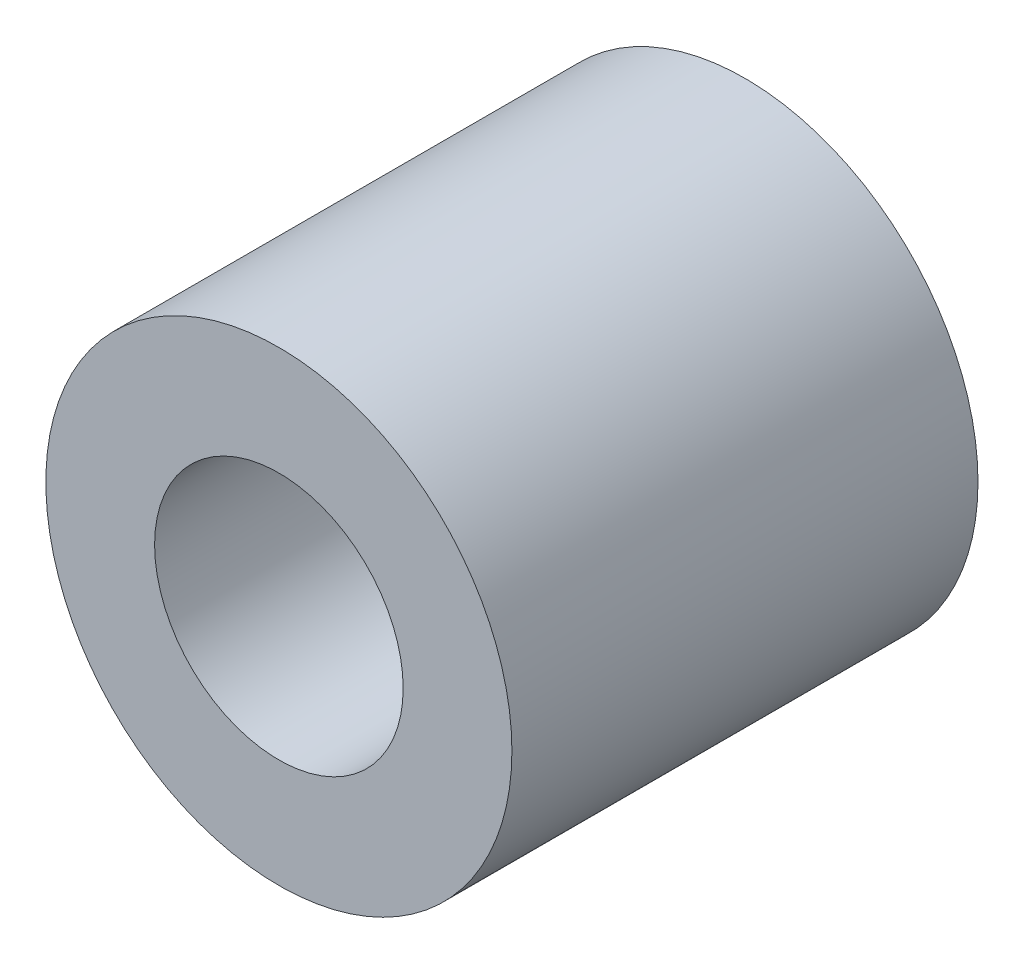
ISO-10303-21;
HEADER;
FILE_DESCRIPTION(('STEP AP214'),'2;1');
FILE_NAME('part.step','',(''),(''),'','','');
FILE_SCHEMA(('AUTOMOTIVE_DESIGN { 1 0 10303 214 1 1 1 1 }'));
ENDSEC;
DATA;
#1=APPLICATION_CONTEXT('core data for automotive mechanical design processes');
#2=APPLICATION_PROTOCOL_DEFINITION('international standard','automotive_design',2000,#1);
#3=PRODUCT_CONTEXT('',#1,'mechanical');
#4=PRODUCT('Part','Part','',(#3));
#5=PRODUCT_RELATED_PRODUCT_CATEGORY('part','',(#4));
#6=PRODUCT_DEFINITION_FORMATION('','',#4);
#7=PRODUCT_DEFINITION_CONTEXT('part definition',#1,'design');
#8=PRODUCT_DEFINITION('design','',#6,#7);
#9=PRODUCT_DEFINITION_SHAPE('','',#8);
#10=(LENGTH_UNIT() NAMED_UNIT(*) SI_UNIT(.MILLI.,.METRE.));
#11=(NAMED_UNIT(*) PLANE_ANGLE_UNIT() SI_UNIT($,.RADIAN.));
#12=(NAMED_UNIT(*) SI_UNIT($,.STERADIAN.) SOLID_ANGLE_UNIT());
#13=UNCERTAINTY_MEASURE_WITH_UNIT(LENGTH_MEASURE(1.E-05),#10,'distance_accuracy_value','');
#14=(GEOMETRIC_REPRESENTATION_CONTEXT(3) GLOBAL_UNCERTAINTY_ASSIGNED_CONTEXT((#13)) GLOBAL_UNIT_ASSIGNED_CONTEXT((#10,
#11,#12)) REPRESENTATION_CONTEXT('',''));
#15=CARTESIAN_POINT('',(0.,0.,0.));
#16=DIRECTION('',(0.,0.,1.));
#17=DIRECTION('',(1.,0.,0.));
#18=AXIS2_PLACEMENT_3D('',#15,#16,#17);
#19=CARTESIAN_POINT('',(0.,0.,0.));
#20=DIRECTION('',(0.,0.,-1.));
#21=DIRECTION('',(-1.,0.,0.));
#22=AXIS2_PLACEMENT_3D('',#19,#20,#21);
#23=PLANE('',#22);
#24=CARTESIAN_POINT('',(0.,0.,0.));
#25=DIRECTION('',(0.,0.,1.));
#26=DIRECTION('',(1.,0.,0.));
#27=AXIS2_PLACEMENT_3D('',#24,#25,#26);
#28=CIRCLE('',#27,0.8);
#29=CARTESIAN_POINT('',(0.8,0.,0.));
#30=VERTEX_POINT('',#29);
#31=EDGE_CURVE('E38',#30,#30,#28,.T.);
#32=ORIENTED_EDGE('',*,*,#31,.F.);
#33=EDGE_LOOP('',(#32));
#34=FACE_BOUND('',#33,.T.);
#35=CARTESIAN_POINT('',(0.,0.,0.));
#36=DIRECTION('',(0.,0.,1.));
#37=DIRECTION('',(1.,0.,0.));
#38=AXIS2_PLACEMENT_3D('',#35,#36,#37);
#39=CIRCLE('',#38,1.5);
#40=CARTESIAN_POINT('',(1.5,0.,0.));
#41=VERTEX_POINT('',#40);
#42=EDGE_CURVE('E46',#41,#41,#39,.T.);
#43=ORIENTED_EDGE('',*,*,#42,.T.);
#44=EDGE_LOOP('',(#43));
#45=FACE_BOUND('',#44,.T.);
#46=ADVANCED_FACE('F32',(#34,#45),#23,.F.);
#47=CARTESIAN_POINT('',(0.,0.,-3.));
#48=DIRECTION('',(0.,0.,1.));
#49=DIRECTION('',(1.,0.,0.));
#50=AXIS2_PLACEMENT_3D('',#47,#48,#49);
#51=PLANE('',#50);
#52=CARTESIAN_POINT('',(0.,0.,-3.));
#53=DIRECTION('',(0.,0.,1.));
#54=DIRECTION('',(1.,0.,0.));
#55=AXIS2_PLACEMENT_3D('',#52,#53,#54);
#56=CIRCLE('',#55,0.799999999999999);
#57=CARTESIAN_POINT('',(0.799999999999999,0.,-3.));
#58=VERTEX_POINT('',#57);
#59=EDGE_CURVE('E10',#58,#58,#56,.T.);
#60=ORIENTED_EDGE('',*,*,#59,.T.);
#61=EDGE_LOOP('',(#60));
#62=FACE_BOUND('',#61,.T.);
#63=CARTESIAN_POINT('',(0.,0.,-3.));
#64=DIRECTION('',(0.,0.,1.));
#65=DIRECTION('',(1.,0.,0.));
#66=AXIS2_PLACEMENT_3D('',#63,#64,#65);
#67=CIRCLE('',#66,1.5);
#68=CARTESIAN_POINT('',(1.5,0.,-3.));
#69=VERTEX_POINT('',#68);
#70=EDGE_CURVE('E42',#69,#69,#67,.F.);
#71=ORIENTED_EDGE('',*,*,#70,.T.);
#72=EDGE_LOOP('',(#71));
#73=FACE_BOUND('',#72,.T.);
#74=ADVANCED_FACE('F61',(#62,#73),#51,.F.);
#75=CARTESIAN_POINT('',(0.,0.,0.));
#76=DIRECTION('',(0.,0.,1.));
#77=DIRECTION('',(1.,0.,0.));
#78=AXIS2_PLACEMENT_3D('',#75,#76,#77);
#79=CYLINDRICAL_SURFACE('',#78,0.799999999999999);
#80=ORIENTED_EDGE('',*,*,#59,.F.);
#81=EDGE_LOOP('',(#80));
#82=FACE_BOUND('',#81,.T.);
#83=ORIENTED_EDGE('',*,*,#31,.T.);
#84=EDGE_LOOP('',(#83));
#85=FACE_BOUND('',#84,.T.);
#86=ADVANCED_FACE('F55',(#82,#85),#79,.F.);
#87=CARTESIAN_POINT('',(0.,0.,-7.24264068711929));
#88=DIRECTION('',(0.,0.,1.));
#89=DIRECTION('',(1.,0.,0.));
#90=AXIS2_PLACEMENT_3D('',#87,#88,#89);
#91=CYLINDRICAL_SURFACE('',#90,1.5);
#92=ORIENTED_EDGE('',*,*,#70,.F.);
#93=EDGE_LOOP('',(#92));
#94=FACE_BOUND('',#93,.T.);
#95=ORIENTED_EDGE('',*,*,#42,.F.);
#96=EDGE_LOOP('',(#95));
#97=FACE_BOUND('',#96,.T.);
#98=ADVANCED_FACE('F53',(#94,#97),#91,.T.);
#99=CLOSED_SHELL('',(#46,#74,#86,#98));
#100=MANIFOLD_SOLID_BREP('B2',#99);
#101=ADVANCED_BREP_SHAPE_REPRESENTATION('',(#18,#100),#14);
#102=SHAPE_DEFINITION_REPRESENTATION(#9,#101);
ENDSEC;
END-ISO-10303-21;
